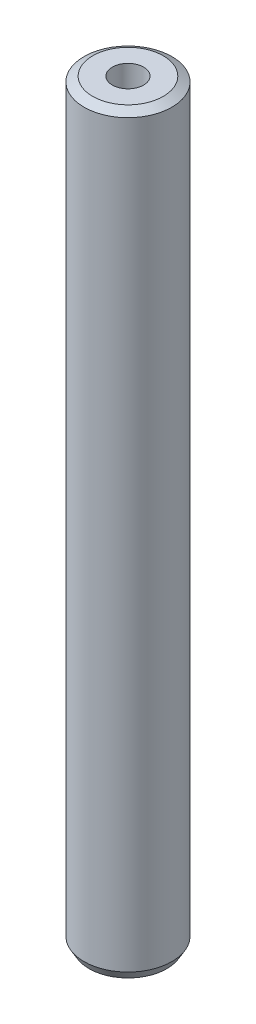
ISO-10303-21;
HEADER;
FILE_DESCRIPTION(('STEP AP214'),'2;1');
FILE_NAME('part.step','',(''),(''),'','','');
FILE_SCHEMA(('AUTOMOTIVE_DESIGN { 1 0 10303 214 1 1 1 1 }'));
ENDSEC;
DATA;
#1=APPLICATION_CONTEXT('core data for automotive mechanical design processes');
#2=APPLICATION_PROTOCOL_DEFINITION('international standard','automotive_design',2000,#1);
#3=PRODUCT_CONTEXT('',#1,'mechanical');
#4=PRODUCT('Part','Part','',(#3));
#5=PRODUCT_RELATED_PRODUCT_CATEGORY('part','',(#4));
#6=PRODUCT_DEFINITION_FORMATION('','',#4);
#7=PRODUCT_DEFINITION_CONTEXT('part definition',#1,'design');
#8=PRODUCT_DEFINITION('design','',#6,#7);
#9=PRODUCT_DEFINITION_SHAPE('','',#8);
#10=(LENGTH_UNIT() NAMED_UNIT(*) SI_UNIT(.MILLI.,.METRE.));
#11=(NAMED_UNIT(*) PLANE_ANGLE_UNIT() SI_UNIT($,.RADIAN.));
#12=(NAMED_UNIT(*) SI_UNIT($,.STERADIAN.) SOLID_ANGLE_UNIT());
#13=UNCERTAINTY_MEASURE_WITH_UNIT(LENGTH_MEASURE(1.E-05),#10,'distance_accuracy_value','');
#14=(GEOMETRIC_REPRESENTATION_CONTEXT(3) GLOBAL_UNCERTAINTY_ASSIGNED_CONTEXT((#13)) GLOBAL_UNIT_ASSIGNED_CONTEXT((#10,
#11,#12)) REPRESENTATION_CONTEXT('',''));
#15=CARTESIAN_POINT('',(0.,0.,0.));
#16=DIRECTION('',(0.,0.,1.));
#17=DIRECTION('',(1.,0.,0.));
#18=AXIS2_PLACEMENT_3D('',#15,#16,#17);
#19=CARTESIAN_POINT('',(0.,85.7918566619022,0.));
#20=DIRECTION('',(0.,-1.,0.));
#21=DIRECTION('',(0.,0.,-1.));
#22=AXIS2_PLACEMENT_3D('',#19,#20,#21);
#23=CYLINDRICAL_SURFACE('',#22,5.);
#24=CARTESIAN_POINT('',(0.,85.2223161031234,0.));
#25=DIRECTION('',(0.,1.,0.));
#26=DIRECTION('',(0.,0.,1.));
#27=AXIS2_PLACEMENT_3D('',#24,#25,#26);
#28=CIRCLE('',#27,5.);
#29=CARTESIAN_POINT('',(0.,85.2223161031234,5.));
#30=VERTEX_POINT('',#29);
#31=EDGE_CURVE('E50',#30,#30,#28,.F.);
#32=ORIENTED_EDGE('',*,*,#31,.T.);
#33=EDGE_LOOP('',(#32));
#34=FACE_BOUND('',#33,.T.);
#35=CARTESIAN_POINT('',(0.,0.986473184776085,0.));
#36=DIRECTION('',(0.,1.,0.));
#37=DIRECTION('',(0.,0.,1.));
#38=AXIS2_PLACEMENT_3D('',#35,#36,#37);
#39=CIRCLE('',#38,5.);
#40=CARTESIAN_POINT('',(0.,0.986473184776085,5.));
#41=VERTEX_POINT('',#40);
#42=EDGE_CURVE('E51',#41,#41,#39,.T.);
#43=ORIENTED_EDGE('',*,*,#42,.T.);
#44=EDGE_LOOP('',(#43));
#45=FACE_BOUND('',#44,.T.);
#46=ADVANCED_FACE('F39',(#34,#45),#23,.T.);
#47=CARTESIAN_POINT('',(0.,85.7918566619022,0.));
#48=DIRECTION('',(0.,1.,0.));
#49=DIRECTION('',(0.,0.,1.));
#50=AXIS2_PLACEMENT_3D('',#47,#48,#49);
#51=PLANE('',#50);
#52=CARTESIAN_POINT('',(0.,85.7918566619022,0.));
#53=DIRECTION('',(0.,1.,0.));
#54=DIRECTION('',(0.,0.,1.));
#55=AXIS2_PLACEMENT_3D('',#52,#53,#54);
#56=CIRCLE('',#55,4.01352681522398);
#57=CARTESIAN_POINT('',(0.,85.7918566619022,4.01352681522398));
#58=VERTEX_POINT('',#57);
#59=EDGE_CURVE('E54',#58,#58,#56,.T.);
#60=ORIENTED_EDGE('',*,*,#59,.T.);
#61=EDGE_LOOP('',(#60));
#62=FACE_BOUND('',#61,.T.);
#63=CARTESIAN_POINT('',(0.,85.7918566619022,0.));
#64=DIRECTION('',(0.,1.,0.));
#65=DIRECTION('',(0.,0.,1.));
#66=AXIS2_PLACEMENT_3D('',#63,#64,#65);
#67=CIRCLE('',#66,1.7790586106368);
#68=CARTESIAN_POINT('',(0.,85.7918566619022,1.7790586106368));
#69=VERTEX_POINT('',#68);
#70=EDGE_CURVE('E58',#69,#69,#67,.T.);
#71=ORIENTED_EDGE('',*,*,#70,.F.);
#72=EDGE_LOOP('',(#71));
#73=FACE_BOUND('',#72,.T.);
#74=ADVANCED_FACE('F69',(#62,#73),#51,.T.);
#75=CARTESIAN_POINT('',(0.,0.,0.));
#76=DIRECTION('',(0.,1.,0.));
#77=DIRECTION('',(0.,0.,1.));
#78=AXIS2_PLACEMENT_3D('',#75,#76,#77);
#79=PLANE('',#78);
#80=CARTESIAN_POINT('',(0.,0.,0.));
#81=DIRECTION('',(0.,1.,0.));
#82=DIRECTION('',(0.,0.,1.));
#83=AXIS2_PLACEMENT_3D('',#80,#81,#82);
#84=CIRCLE('',#83,4.43045944122118);
#85=CARTESIAN_POINT('',(0.,0.,4.43045944122118));
#86=VERTEX_POINT('',#85);
#87=EDGE_CURVE('E10',#86,#86,#84,.F.);
#88=ORIENTED_EDGE('',*,*,#87,.T.);
#89=EDGE_LOOP('',(#88));
#90=FACE_BOUND('',#89,.T.);
#91=CARTESIAN_POINT('',(0.,0.,0.));
#92=DIRECTION('',(0.,1.,0.));
#93=DIRECTION('',(0.,0.,1.));
#94=AXIS2_PLACEMENT_3D('',#91,#92,#93);
#95=CIRCLE('',#94,1.7790586106368);
#96=CARTESIAN_POINT('',(0.,0.,1.7790586106368));
#97=VERTEX_POINT('',#96);
#98=EDGE_CURVE('E63',#97,#97,#95,.T.);
#99=ORIENTED_EDGE('',*,*,#98,.T.);
#100=EDGE_LOOP('',(#99));
#101=FACE_BOUND('',#100,.T.);
#102=ADVANCED_FACE('F75',(#90,#101),#79,.F.);
#103=CARTESIAN_POINT('',(0.,85.7918566619022,0.));
#104=DIRECTION('',(0.,-1.,0.));
#105=DIRECTION('',(0.,0.,-1.));
#106=AXIS2_PLACEMENT_3D('',#103,#104,#105);
#107=CYLINDRICAL_SURFACE('',#106,1.7790586106368);
#108=ORIENTED_EDGE('',*,*,#70,.T.);
#109=EDGE_LOOP('',(#108));
#110=FACE_BOUND('',#109,.T.);
#111=ORIENTED_EDGE('',*,*,#98,.F.);
#112=EDGE_LOOP('',(#111));
#113=FACE_BOUND('',#112,.T.);
#114=ADVANCED_FACE('F70',(#110,#113),#107,.F.);
#115=CARTESIAN_POINT('',(0.,85.7918566619022,0.));
#116=DIRECTION('',(0.,-1.,0.));
#117=DIRECTION('',(0.,0.,-1.));
#118=AXIS2_PLACEMENT_3D('',#115,#116,#117);
#119=CONICAL_SURFACE('',#118,4.01352681522398,1.04719755119659);
#120=ORIENTED_EDGE('',*,*,#31,.F.);
#121=EDGE_LOOP('',(#120));
#122=FACE_BOUND('',#121,.T.);
#123=ORIENTED_EDGE('',*,*,#59,.F.);
#124=EDGE_LOOP('',(#123));
#125=FACE_BOUND('',#124,.T.);
#126=ADVANCED_FACE('F81',(#122,#125),#119,.T.);
#127=CARTESIAN_POINT('',(0.,0.986473184776085,0.));
#128=DIRECTION('',(0.,1.,0.));
#129=DIRECTION('',(0.,0.,1.));
#130=AXIS2_PLACEMENT_3D('',#127,#128,#129);
#131=CONICAL_SURFACE('',#130,5.,0.523598775598297);
#132=ORIENTED_EDGE('',*,*,#87,.F.);
#133=EDGE_LOOP('',(#132));
#134=FACE_BOUND('',#133,.T.);
#135=ORIENTED_EDGE('',*,*,#42,.F.);
#136=EDGE_LOOP('',(#135));
#137=FACE_BOUND('',#136,.T.);
#138=ADVANCED_FACE('F45',(#134,#137),#131,.T.);
#139=CLOSED_SHELL('',(#46,#74,#102,#114,#126,#138));
#140=MANIFOLD_SOLID_BREP('B2',#139);
#141=ADVANCED_BREP_SHAPE_REPRESENTATION('',(#18,#140),#14);
#142=SHAPE_DEFINITION_REPRESENTATION(#9,#141);
ENDSEC;
END-ISO-10303-21;
